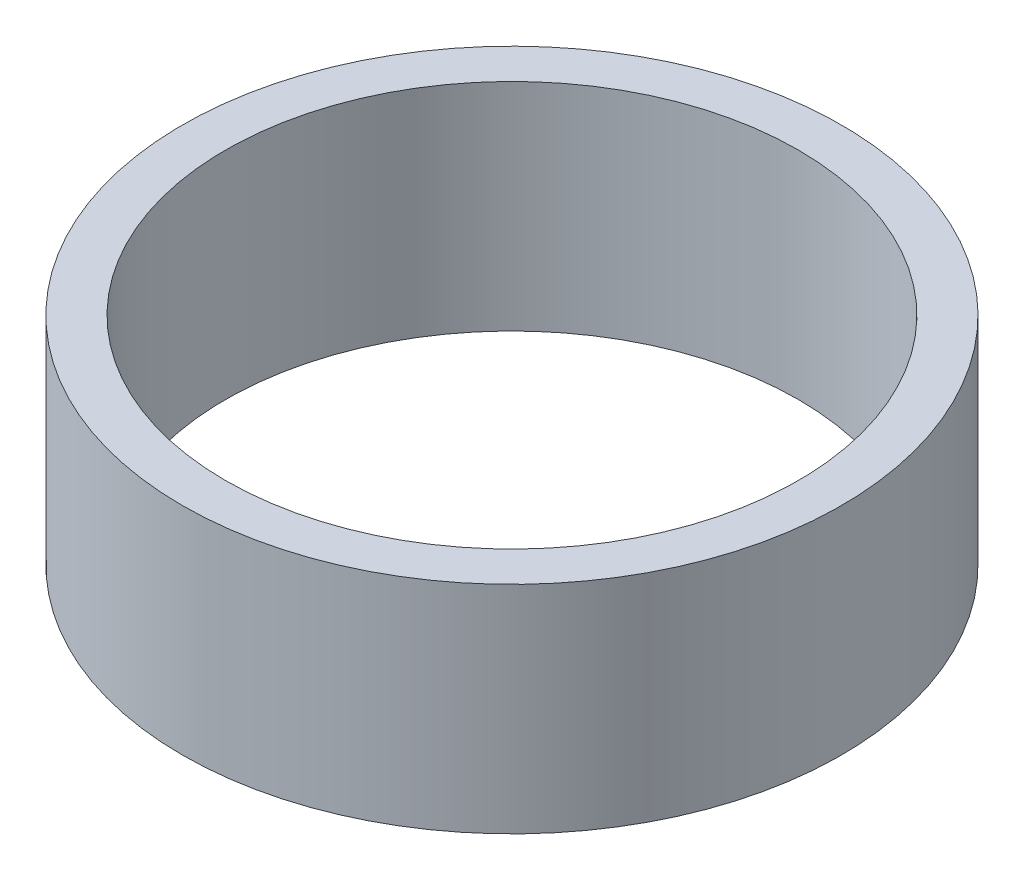
ISO-10303-21;
HEADER;
FILE_DESCRIPTION(('STEP AP214'),'2;1');
FILE_NAME('part.step','',(''),(''),'','','');
FILE_SCHEMA(('AUTOMOTIVE_DESIGN { 1 0 10303 214 1 1 1 1 }'));
ENDSEC;
DATA;
#1=APPLICATION_CONTEXT('core data for automotive mechanical design processes');
#2=APPLICATION_PROTOCOL_DEFINITION('international standard','automotive_design',2000,#1);
#3=PRODUCT_CONTEXT('',#1,'mechanical');
#4=PRODUCT('Part','Part','',(#3));
#5=PRODUCT_RELATED_PRODUCT_CATEGORY('part','',(#4));
#6=PRODUCT_DEFINITION_FORMATION('','',#4);
#7=PRODUCT_DEFINITION_CONTEXT('part definition',#1,'design');
#8=PRODUCT_DEFINITION('design','',#6,#7);
#9=PRODUCT_DEFINITION_SHAPE('','',#8);
#10=(LENGTH_UNIT() NAMED_UNIT(*) SI_UNIT(.MILLI.,.METRE.));
#11=(NAMED_UNIT(*) PLANE_ANGLE_UNIT() SI_UNIT($,.RADIAN.));
#12=(NAMED_UNIT(*) SI_UNIT($,.STERADIAN.) SOLID_ANGLE_UNIT());
#13=UNCERTAINTY_MEASURE_WITH_UNIT(LENGTH_MEASURE(1.E-05),#10,'distance_accuracy_value','');
#14=(GEOMETRIC_REPRESENTATION_CONTEXT(3) GLOBAL_UNCERTAINTY_ASSIGNED_CONTEXT((#13)) GLOBAL_UNIT_ASSIGNED_CONTEXT((#10,
#11,#12)) REPRESENTATION_CONTEXT('',''));
#15=CARTESIAN_POINT('',(0.,0.,0.));
#16=DIRECTION('',(0.,0.,1.));
#17=DIRECTION('',(1.,0.,0.));
#18=AXIS2_PLACEMENT_3D('',#15,#16,#17);
#19=CARTESIAN_POINT('',(0.,10.,0.));
#20=DIRECTION('',(0.,1.,0.));
#21=DIRECTION('',(0.,0.,1.));
#22=AXIS2_PLACEMENT_3D('',#19,#20,#21);
#23=PLANE('',#22);
#24=CARTESIAN_POINT('',(0.,10.,0.));
#25=DIRECTION('',(0.,1.,0.));
#26=DIRECTION('',(0.,0.,1.));
#27=AXIS2_PLACEMENT_3D('',#24,#25,#26);
#28=CIRCLE('',#27,15.25);
#29=CARTESIAN_POINT('',(0.,10.,15.25));
#30=VERTEX_POINT('',#29);
#31=EDGE_CURVE('E10',#30,#30,#28,.T.);
#32=ORIENTED_EDGE('',*,*,#31,.T.);
#33=EDGE_LOOP('',(#32));
#34=FACE_BOUND('',#33,.T.);
#35=CARTESIAN_POINT('',(0.,10.,0.));
#36=DIRECTION('',(0.,1.,0.));
#37=DIRECTION('',(0.,0.,1.));
#38=AXIS2_PLACEMENT_3D('',#35,#36,#37);
#39=CIRCLE('',#38,13.2499999999993);
#40=CARTESIAN_POINT('',(0.,10.,13.2499999999993));
#41=VERTEX_POINT('',#40);
#42=EDGE_CURVE('E42',#41,#41,#39,.T.);
#43=ORIENTED_EDGE('',*,*,#42,.F.);
#44=EDGE_LOOP('',(#43));
#45=FACE_BOUND('',#44,.T.);
#46=ADVANCED_FACE('F31',(#34,#45),#23,.T.);
#47=CARTESIAN_POINT('',(0.,0.,0.));
#48=DIRECTION('',(0.,1.,0.));
#49=DIRECTION('',(0.,0.,1.));
#50=AXIS2_PLACEMENT_3D('',#47,#48,#49);
#51=PLANE('',#50);
#52=CARTESIAN_POINT('',(0.,0.,0.));
#53=DIRECTION('',(0.,1.,0.));
#54=DIRECTION('',(0.,0.,1.));
#55=AXIS2_PLACEMENT_3D('',#52,#53,#54);
#56=CIRCLE('',#55,15.25);
#57=CARTESIAN_POINT('',(0.,0.,15.25));
#58=VERTEX_POINT('',#57);
#59=EDGE_CURVE('E35',#58,#58,#56,.T.);
#60=ORIENTED_EDGE('',*,*,#59,.F.);
#61=EDGE_LOOP('',(#60));
#62=FACE_BOUND('',#61,.T.);
#63=CARTESIAN_POINT('',(0.,0.,0.));
#64=DIRECTION('',(0.,1.,0.));
#65=DIRECTION('',(0.,0.,1.));
#66=AXIS2_PLACEMENT_3D('',#63,#64,#65);
#67=CIRCLE('',#66,13.2499999999993);
#68=CARTESIAN_POINT('',(0.,0.,13.2499999999993));
#69=VERTEX_POINT('',#68);
#70=EDGE_CURVE('E44',#69,#69,#67,.T.);
#71=ORIENTED_EDGE('',*,*,#70,.T.);
#72=EDGE_LOOP('',(#71));
#73=FACE_BOUND('',#72,.T.);
#74=ADVANCED_FACE('F54',(#62,#73),#51,.F.);
#75=CARTESIAN_POINT('',(0.,10.,0.));
#76=DIRECTION('',(0.,-1.,0.));
#77=DIRECTION('',(0.,0.,-1.));
#78=AXIS2_PLACEMENT_3D('',#75,#76,#77);
#79=CYLINDRICAL_SURFACE('',#78,15.25);
#80=ORIENTED_EDGE('',*,*,#31,.F.);
#81=EDGE_LOOP('',(#80));
#82=FACE_BOUND('',#81,.T.);
#83=ORIENTED_EDGE('',*,*,#59,.T.);
#84=EDGE_LOOP('',(#83));
#85=FACE_BOUND('',#84,.T.);
#86=ADVANCED_FACE('F33',(#82,#85),#79,.T.);
#87=CARTESIAN_POINT('',(0.,10.,0.));
#88=DIRECTION('',(0.,-1.,0.));
#89=DIRECTION('',(0.,0.,-1.));
#90=AXIS2_PLACEMENT_3D('',#87,#88,#89);
#91=CYLINDRICAL_SURFACE('',#90,13.2499999999993);
#92=ORIENTED_EDGE('',*,*,#42,.T.);
#93=EDGE_LOOP('',(#92));
#94=FACE_BOUND('',#93,.T.);
#95=ORIENTED_EDGE('',*,*,#70,.F.);
#96=EDGE_LOOP('',(#95));
#97=FACE_BOUND('',#96,.T.);
#98=ADVANCED_FACE('F50',(#94,#97),#91,.F.);
#99=CLOSED_SHELL('',(#46,#74,#86,#98));
#100=MANIFOLD_SOLID_BREP('B2',#99);
#101=ADVANCED_BREP_SHAPE_REPRESENTATION('',(#18,#100),#14);
#102=SHAPE_DEFINITION_REPRESENTATION(#9,#101);
ENDSEC;
END-ISO-10303-21;
